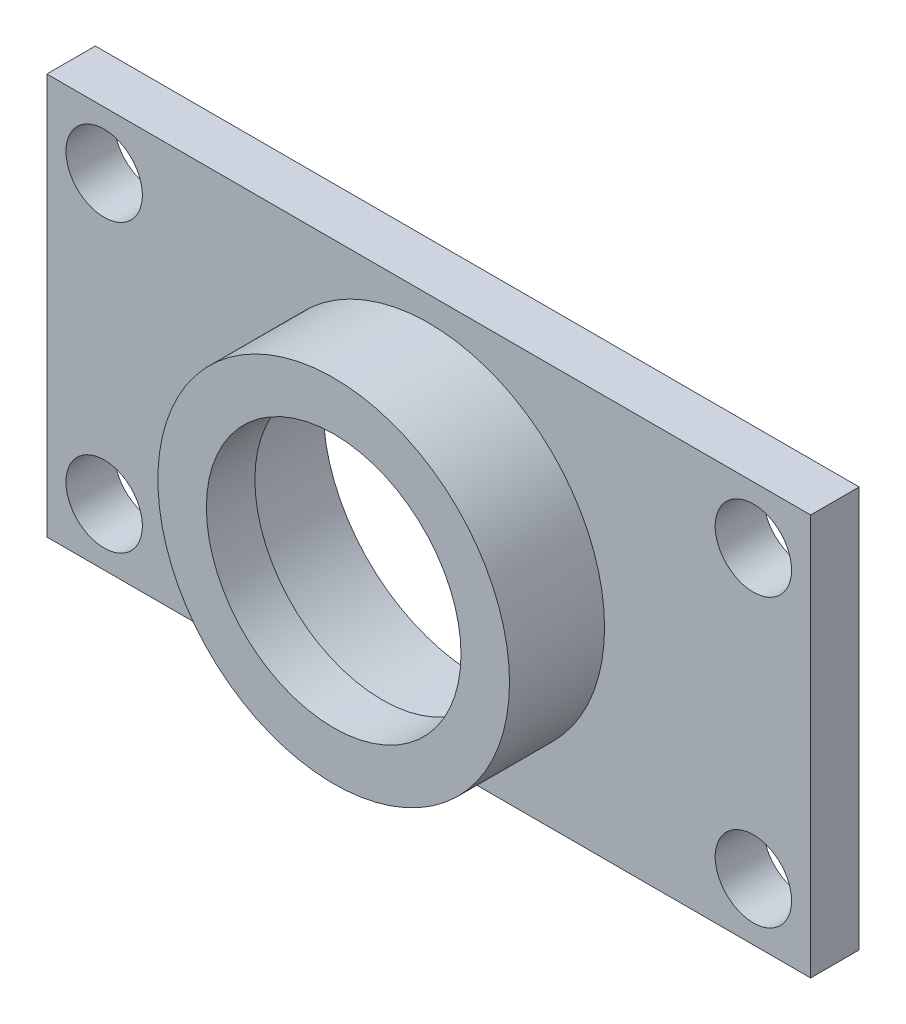
ISO-10303-21;
HEADER;
FILE_DESCRIPTION(('STEP AP214'),'2;1');
FILE_NAME('part.step','',(''),(''),'','','');
FILE_SCHEMA(('AUTOMOTIVE_DESIGN { 1 0 10303 214 1 1 1 1 }'));
ENDSEC;
DATA;
#1=APPLICATION_CONTEXT('core data for automotive mechanical design processes');
#2=APPLICATION_PROTOCOL_DEFINITION('international standard','automotive_design',2000,#1);
#3=PRODUCT_CONTEXT('',#1,'mechanical');
#4=PRODUCT('Part','Part','',(#3));
#5=PRODUCT_RELATED_PRODUCT_CATEGORY('part','',(#4));
#6=PRODUCT_DEFINITION_FORMATION('','',#4);
#7=PRODUCT_DEFINITION_CONTEXT('part definition',#1,'design');
#8=PRODUCT_DEFINITION('design','',#6,#7);
#9=PRODUCT_DEFINITION_SHAPE('','',#8);
#10=(LENGTH_UNIT() NAMED_UNIT(*) SI_UNIT(.MILLI.,.METRE.));
#11=(NAMED_UNIT(*) PLANE_ANGLE_UNIT() SI_UNIT($,.RADIAN.));
#12=(NAMED_UNIT(*) SI_UNIT($,.STERADIAN.) SOLID_ANGLE_UNIT());
#13=UNCERTAINTY_MEASURE_WITH_UNIT(LENGTH_MEASURE(1.E-05),#10,'distance_accuracy_value','');
#14=(GEOMETRIC_REPRESENTATION_CONTEXT(3) GLOBAL_UNCERTAINTY_ASSIGNED_CONTEXT((#13)) GLOBAL_UNIT_ASSIGNED_CONTEXT((#10,
#11,#12)) REPRESENTATION_CONTEXT('',''));
#15=CARTESIAN_POINT('',(0.,0.,0.));
#16=DIRECTION('',(0.,0.,1.));
#17=DIRECTION('',(1.,0.,0.));
#18=AXIS2_PLACEMENT_3D('',#15,#16,#17);
#19=CARTESIAN_POINT('',(0.,0.,2.54));
#20=DIRECTION('',(1.,0.,0.));
#21=DIRECTION('',(0.,0.,-1.));
#22=AXIS2_PLACEMENT_3D('',#19,#20,#21);
#23=PLANE('',#22);
#24=DIRECTION('',(0.,-1.,0.));
#25=VECTOR('',#24,1.);
#26=CARTESIAN_POINT('',(0.,0.,0.));
#27=LINE('',#26,#25);
#28=CARTESIAN_POINT('',(0.,21.,0.));
#29=VERTEX_POINT('',#28);
#30=CARTESIAN_POINT('',(0.,0.,0.));
#31=VERTEX_POINT('',#30);
#32=EDGE_CURVE('E99',#29,#31,#27,.T.);
#33=ORIENTED_EDGE('',*,*,#32,.T.);
#34=DIRECTION('',(0.,0.,-1.));
#35=VECTOR('',#34,1.);
#36=CARTESIAN_POINT('',(0.,0.,2.54));
#37=LINE('',#36,#35);
#38=CARTESIAN_POINT('',(0.,0.,2.54));
#39=VERTEX_POINT('',#38);
#40=EDGE_CURVE('E36',#39,#31,#37,.T.);
#41=ORIENTED_EDGE('',*,*,#40,.F.);
#42=DIRECTION('',(0.,-1.,0.));
#43=VECTOR('',#42,1.);
#44=CARTESIAN_POINT('',(0.,0.,2.54));
#45=LINE('',#44,#43);
#46=CARTESIAN_POINT('',(0.,21.,2.54));
#47=VERTEX_POINT('',#46);
#48=EDGE_CURVE('E86',#47,#39,#45,.T.);
#49=ORIENTED_EDGE('',*,*,#48,.F.);
#50=DIRECTION('',(0.,0.,-1.));
#51=VECTOR('',#50,1.);
#52=CARTESIAN_POINT('',(0.,21.,2.54));
#53=LINE('',#52,#51);
#54=EDGE_CURVE('E95',#47,#29,#53,.T.);
#55=ORIENTED_EDGE('',*,*,#54,.T.);
#56=EDGE_LOOP('',(#33,#41,#49,#55));
#57=FACE_BOUND('',#56,.T.);
#58=ADVANCED_FACE('F33',(#57),#23,.F.);
#59=CARTESIAN_POINT('',(0.,0.,2.54));
#60=DIRECTION('',(0.,1.,0.));
#61=DIRECTION('',(0.,0.,1.));
#62=AXIS2_PLACEMENT_3D('',#59,#60,#61);
#63=PLANE('',#62);
#64=DIRECTION('',(1.,0.,0.));
#65=VECTOR('',#64,1.);
#66=CARTESIAN_POINT('',(0.,0.,0.));
#67=LINE('',#66,#65);
#68=CARTESIAN_POINT('',(40.,0.,0.));
#69=VERTEX_POINT('',#68);
#70=EDGE_CURVE('E91',#31,#69,#67,.T.);
#71=ORIENTED_EDGE('',*,*,#70,.T.);
#72=DIRECTION('',(0.,0.,-1.));
#73=VECTOR('',#72,1.);
#74=CARTESIAN_POINT('',(40.,0.,2.54));
#75=LINE('',#74,#73);
#76=CARTESIAN_POINT('',(40.,0.,2.54));
#77=VERTEX_POINT('',#76);
#78=EDGE_CURVE('E89',#77,#69,#75,.T.);
#79=ORIENTED_EDGE('',*,*,#78,.F.);
#80=DIRECTION('',(1.,0.,0.));
#81=VECTOR('',#80,1.);
#82=CARTESIAN_POINT('',(0.,0.,2.54));
#83=LINE('',#82,#81);
#84=EDGE_CURVE('E81',#39,#77,#83,.T.);
#85=ORIENTED_EDGE('',*,*,#84,.F.);
#86=ORIENTED_EDGE('',*,*,#40,.T.);
#87=EDGE_LOOP('',(#71,#79,#85,#86));
#88=FACE_BOUND('',#87,.T.);
#89=ADVANCED_FACE('F90',(#88),#63,.F.);
#90=CARTESIAN_POINT('',(40.,0.,2.54));
#91=DIRECTION('',(-1.,0.,0.));
#92=DIRECTION('',(0.,0.,1.));
#93=AXIS2_PLACEMENT_3D('',#90,#91,#92);
#94=PLANE('',#93);
#95=DIRECTION('',(0.,1.,0.));
#96=VECTOR('',#95,1.);
#97=CARTESIAN_POINT('',(40.,0.,0.));
#98=LINE('',#97,#96);
#99=CARTESIAN_POINT('',(40.,21.,0.));
#100=VERTEX_POINT('',#99);
#101=EDGE_CURVE('E67',#69,#100,#98,.T.);
#102=ORIENTED_EDGE('',*,*,#101,.T.);
#103=DIRECTION('',(0.,0.,-1.));
#104=VECTOR('',#103,1.);
#105=CARTESIAN_POINT('',(40.,21.,2.54));
#106=LINE('',#105,#104);
#107=CARTESIAN_POINT('',(40.,21.,2.54));
#108=VERTEX_POINT('',#107);
#109=EDGE_CURVE('E92',#108,#100,#106,.T.);
#110=ORIENTED_EDGE('',*,*,#109,.F.);
#111=DIRECTION('',(0.,1.,0.));
#112=VECTOR('',#111,1.);
#113=CARTESIAN_POINT('',(40.,0.,2.54));
#114=LINE('',#113,#112);
#115=EDGE_CURVE('E84',#77,#108,#114,.T.);
#116=ORIENTED_EDGE('',*,*,#115,.F.);
#117=ORIENTED_EDGE('',*,*,#78,.T.);
#118=EDGE_LOOP('',(#102,#110,#116,#117));
#119=FACE_BOUND('',#118,.T.);
#120=ADVANCED_FACE('F93',(#119),#94,.F.);
#121=CARTESIAN_POINT('',(0.,21.,2.54));
#122=DIRECTION('',(0.,-1.,0.));
#123=DIRECTION('',(0.,0.,-1.));
#124=AXIS2_PLACEMENT_3D('',#121,#122,#123);
#125=PLANE('',#124);
#126=DIRECTION('',(-1.,0.,0.));
#127=VECTOR('',#126,1.);
#128=CARTESIAN_POINT('',(0.,21.,0.));
#129=LINE('',#128,#127);
#130=EDGE_CURVE('E73',#100,#29,#129,.T.);
#131=ORIENTED_EDGE('',*,*,#130,.T.);
#132=ORIENTED_EDGE('',*,*,#54,.F.);
#133=DIRECTION('',(-1.,0.,0.));
#134=VECTOR('',#133,1.);
#135=CARTESIAN_POINT('',(0.,21.,2.54));
#136=LINE('',#135,#134);
#137=EDGE_CURVE('E50',#108,#47,#136,.T.);
#138=ORIENTED_EDGE('',*,*,#137,.F.);
#139=ORIENTED_EDGE('',*,*,#109,.T.);
#140=EDGE_LOOP('',(#131,#132,#138,#139));
#141=FACE_BOUND('',#140,.T.);
#142=ADVANCED_FACE('F107',(#141),#125,.F.);
#143=CARTESIAN_POINT('',(0.,0.,2.54));
#144=DIRECTION('',(0.,0.,-1.));
#145=DIRECTION('',(-1.,0.,0.));
#146=AXIS2_PLACEMENT_3D('',#143,#144,#145);
#147=PLANE('',#146);
#148=CARTESIAN_POINT('',(37.000006,2.999994,2.54));
#149=DIRECTION('',(0.,0.,1.));
#150=DIRECTION('',(1.,0.,0.));
#151=AXIS2_PLACEMENT_3D('',#148,#149,#150);
#152=CIRCLE('',#151,1.999996);
#153=CARTESIAN_POINT('',(39.000002,2.999994,2.54));
#154=VERTEX_POINT('',#153);
#155=EDGE_CURVE('E141',#154,#154,#152,.T.);
#156=ORIENTED_EDGE('',*,*,#155,.F.);
#157=EDGE_LOOP('',(#156));
#158=FACE_BOUND('',#157,.T.);
#159=CARTESIAN_POINT('',(3.0000156,2.99999399999999,2.54));
#160=DIRECTION('',(0.,0.,1.));
#161=DIRECTION('',(-1.,0.,0.));
#162=AXIS2_PLACEMENT_3D('',#159,#160,#161);
#163=CIRCLE('',#162,1.999996);
#164=CARTESIAN_POINT('',(1.00001960000001,2.99999399999999,2.54));
#165=VERTEX_POINT('',#164);
#166=EDGE_CURVE('E122',#165,#165,#163,.T.);
#167=ORIENTED_EDGE('',*,*,#166,.F.);
#168=EDGE_LOOP('',(#167));
#169=FACE_BOUND('',#168,.T.);
#170=CARTESIAN_POINT('',(37.000006,18.000006,2.54));
#171=DIRECTION('',(0.,0.,1.));
#172=DIRECTION('',(1.,0.,0.));
#173=AXIS2_PLACEMENT_3D('',#170,#171,#172);
#174=CIRCLE('',#173,1.999996);
#175=CARTESIAN_POINT('',(39.000002,18.000006,2.54));
#176=VERTEX_POINT('',#175);
#177=EDGE_CURVE('E131',#176,#176,#174,.T.);
#178=ORIENTED_EDGE('',*,*,#177,.F.);
#179=EDGE_LOOP('',(#178));
#180=FACE_BOUND('',#179,.T.);
#181=CARTESIAN_POINT('',(3.0000156,18.000006,2.54));
#182=DIRECTION('',(0.,0.,1.));
#183=DIRECTION('',(-1.,0.,0.));
#184=AXIS2_PLACEMENT_3D('',#181,#182,#183);
#185=CIRCLE('',#184,1.999996);
#186=CARTESIAN_POINT('',(1.0000196,18.000006,2.54));
#187=VERTEX_POINT('',#186);
#188=EDGE_CURVE('E124',#187,#187,#185,.T.);
#189=ORIENTED_EDGE('',*,*,#188,.F.);
#190=EDGE_LOOP('',(#189));
#191=FACE_BOUND('',#190,.T.);
#192=CARTESIAN_POINT('',(20.0000108,10.49999932,2.54));
#193=DIRECTION('',(0.,0.,1.));
#194=DIRECTION('',(1.,0.,0.));
#195=AXIS2_PLACEMENT_3D('',#192,#193,#194);
#196=CIRCLE('',#195,9.2075);
#197=CARTESIAN_POINT('',(29.2075108,10.49999932,2.54));
#198=VERTEX_POINT('',#197);
#199=EDGE_CURVE('E11',#198,#198,#196,.T.);
#200=ORIENTED_EDGE('',*,*,#199,.F.);
#201=EDGE_LOOP('',(#200));
#202=FACE_BOUND('',#201,.T.);
#203=ORIENTED_EDGE('',*,*,#48,.T.);
#204=ORIENTED_EDGE('',*,*,#84,.T.);
#205=ORIENTED_EDGE('',*,*,#115,.T.);
#206=ORIENTED_EDGE('',*,*,#137,.T.);
#207=EDGE_LOOP('',(#203,#204,#205,#206));
#208=FACE_BOUND('',#207,.T.);
#209=ADVANCED_FACE('F82',(#158,#169,#180,#191,#202,#208),#147,.F.);
#210=CARTESIAN_POINT('',(0.,0.,0.));
#211=DIRECTION('',(0.,0.,-1.));
#212=DIRECTION('',(-1.,0.,0.));
#213=AXIS2_PLACEMENT_3D('',#210,#211,#212);
#214=PLANE('',#213);
#215=CARTESIAN_POINT('',(19.9999892,10.49999932,0.));
#216=DIRECTION('',(0.,0.,-1.));
#217=DIRECTION('',(-1.,0.,0.));
#218=AXIS2_PLACEMENT_3D('',#215,#216,#217);
#219=CIRCLE('',#218,8.0645);
#220=CARTESIAN_POINT('',(11.9354892,10.49999932,0.));
#221=VERTEX_POINT('',#220);
#222=EDGE_CURVE('E146',#221,#221,#219,.T.);
#223=ORIENTED_EDGE('',*,*,#222,.F.);
#224=EDGE_LOOP('',(#223));
#225=FACE_BOUND('',#224,.T.);
#226=CARTESIAN_POINT('',(37.000006,2.999994,0.));
#227=DIRECTION('',(0.,0.,1.));
#228=DIRECTION('',(1.,0.,0.));
#229=AXIS2_PLACEMENT_3D('',#226,#227,#228);
#230=CIRCLE('',#229,1.999996);
#231=CARTESIAN_POINT('',(39.000002,2.999994,0.));
#232=VERTEX_POINT('',#231);
#233=EDGE_CURVE('E128',#232,#232,#230,.T.);
#234=ORIENTED_EDGE('',*,*,#233,.T.);
#235=EDGE_LOOP('',(#234));
#236=FACE_BOUND('',#235,.T.);
#237=CARTESIAN_POINT('',(3.0000156,2.99999399999999,0.));
#238=DIRECTION('',(0.,0.,1.));
#239=DIRECTION('',(-1.,0.,0.));
#240=AXIS2_PLACEMENT_3D('',#237,#238,#239);
#241=CIRCLE('',#240,1.999996);
#242=CARTESIAN_POINT('',(1.00001960000001,2.99999399999999,0.));
#243=VERTEX_POINT('',#242);
#244=EDGE_CURVE('E138',#243,#243,#241,.T.);
#245=ORIENTED_EDGE('',*,*,#244,.T.);
#246=EDGE_LOOP('',(#245));
#247=FACE_BOUND('',#246,.T.);
#248=CARTESIAN_POINT('',(37.000006,18.000006,0.));
#249=DIRECTION('',(0.,0.,1.));
#250=DIRECTION('',(1.,0.,0.));
#251=AXIS2_PLACEMENT_3D('',#248,#249,#250);
#252=CIRCLE('',#251,1.999996);
#253=CARTESIAN_POINT('',(39.000002,18.000006,0.));
#254=VERTEX_POINT('',#253);
#255=EDGE_CURVE('E118',#254,#254,#252,.T.);
#256=ORIENTED_EDGE('',*,*,#255,.T.);
#257=EDGE_LOOP('',(#256));
#258=FACE_BOUND('',#257,.T.);
#259=CARTESIAN_POINT('',(3.0000156,18.000006,0.));
#260=DIRECTION('',(0.,0.,1.));
#261=DIRECTION('',(-1.,0.,0.));
#262=AXIS2_PLACEMENT_3D('',#259,#260,#261);
#263=CIRCLE('',#262,1.999996);
#264=CARTESIAN_POINT('',(1.0000196,18.000006,0.));
#265=VERTEX_POINT('',#264);
#266=EDGE_CURVE('E127',#265,#265,#263,.T.);
#267=ORIENTED_EDGE('',*,*,#266,.T.);
#268=EDGE_LOOP('',(#267));
#269=FACE_BOUND('',#268,.T.);
#270=ORIENTED_EDGE('',*,*,#32,.F.);
#271=ORIENTED_EDGE('',*,*,#130,.F.);
#272=ORIENTED_EDGE('',*,*,#101,.F.);
#273=ORIENTED_EDGE('',*,*,#70,.F.);
#274=EDGE_LOOP('',(#270,#271,#272,#273));
#275=FACE_BOUND('',#274,.T.);
#276=ADVANCED_FACE('F110',(#225,#236,#247,#258,#269,#275),#214,.T.);
#277=CARTESIAN_POINT('',(20.0000108,10.49999932,7.5184));
#278=DIRECTION('',(0.,0.,-1.));
#279=DIRECTION('',(-1.,0.,0.));
#280=AXIS2_PLACEMENT_3D('',#277,#278,#279);
#281=CYLINDRICAL_SURFACE('',#280,9.2075);
#282=CARTESIAN_POINT('',(20.0000108,10.49999932,7.5184));
#283=DIRECTION('',(0.,0.,1.));
#284=DIRECTION('',(1.,0.,0.));
#285=AXIS2_PLACEMENT_3D('',#282,#283,#284);
#286=CIRCLE('',#285,9.2075);
#287=CARTESIAN_POINT('',(29.2075108,10.49999932,7.5184));
#288=VERTEX_POINT('',#287);
#289=EDGE_CURVE('E102',#288,#288,#286,.T.);
#290=ORIENTED_EDGE('',*,*,#289,.F.);
#291=EDGE_LOOP('',(#290));
#292=FACE_BOUND('',#291,.T.);
#293=ORIENTED_EDGE('',*,*,#199,.T.);
#294=EDGE_LOOP('',(#293));
#295=FACE_BOUND('',#294,.T.);
#296=ADVANCED_FACE('F163',(#292,#295),#281,.T.);
#297=CARTESIAN_POINT('',(20.0000108,10.49999932,7.5184));
#298=DIRECTION('',(0.,0.,1.));
#299=DIRECTION('',(1.,0.,0.));
#300=AXIS2_PLACEMENT_3D('',#297,#298,#299);
#301=PLANE('',#300);
#302=CARTESIAN_POINT('',(20.0000108,10.49999932,7.5184));
#303=DIRECTION('',(0.,0.,1.));
#304=DIRECTION('',(1.,0.,0.));
#305=AXIS2_PLACEMENT_3D('',#302,#303,#304);
#306=CIRCLE('',#305,6.6675);
#307=CARTESIAN_POINT('',(26.6675108,10.49999932,7.5184));
#308=VERTEX_POINT('',#307);
#309=EDGE_CURVE('E115',#308,#308,#306,.T.);
#310=ORIENTED_EDGE('',*,*,#309,.F.);
#311=EDGE_LOOP('',(#310));
#312=FACE_BOUND('',#311,.T.);
#313=ORIENTED_EDGE('',*,*,#289,.T.);
#314=EDGE_LOOP('',(#313));
#315=FACE_BOUND('',#314,.T.);
#316=ADVANCED_FACE('F188',(#312,#315),#301,.T.);
#317=CARTESIAN_POINT('',(20.0000108,10.49999932,4.9784));
#318=DIRECTION('',(0.,0.,1.));
#319=DIRECTION('',(1.,0.,0.));
#320=AXIS2_PLACEMENT_3D('',#317,#318,#319);
#321=CYLINDRICAL_SURFACE('',#320,6.6675);
#322=CARTESIAN_POINT('',(20.0000108,10.49999932,4.9784));
#323=DIRECTION('',(0.,0.,1.));
#324=DIRECTION('',(1.,0.,0.));
#325=AXIS2_PLACEMENT_3D('',#322,#323,#324);
#326=CIRCLE('',#325,6.6675);
#327=CARTESIAN_POINT('',(26.6675108,10.49999932,4.9784));
#328=VERTEX_POINT('',#327);
#329=EDGE_CURVE('E119',#328,#328,#326,.T.);
#330=ORIENTED_EDGE('',*,*,#329,.F.);
#331=EDGE_LOOP('',(#330));
#332=FACE_BOUND('',#331,.T.);
#333=ORIENTED_EDGE('',*,*,#309,.T.);
#334=EDGE_LOOP('',(#333));
#335=FACE_BOUND('',#334,.T.);
#336=ADVANCED_FACE('F177',(#332,#335),#321,.F.);
#337=CARTESIAN_POINT('',(3.0000156,18.000006,0.));
#338=DIRECTION('',(0.,0.,1.));
#339=DIRECTION('',(1.,0.,0.));
#340=AXIS2_PLACEMENT_3D('',#337,#338,#339);
#341=CYLINDRICAL_SURFACE('',#340,1.999996);
#342=ORIENTED_EDGE('',*,*,#266,.F.);
#343=EDGE_LOOP('',(#342));
#344=FACE_BOUND('',#343,.T.);
#345=ORIENTED_EDGE('',*,*,#188,.T.);
#346=EDGE_LOOP('',(#345));
#347=FACE_BOUND('',#346,.T.);
#348=ADVANCED_FACE('F173',(#344,#347),#341,.F.);
#349=CARTESIAN_POINT('',(37.000006,18.000006,0.));
#350=DIRECTION('',(0.,0.,1.));
#351=DIRECTION('',(1.,0.,0.));
#352=AXIS2_PLACEMENT_3D('',#349,#350,#351);
#353=CYLINDRICAL_SURFACE('',#352,1.999996);
#354=ORIENTED_EDGE('',*,*,#255,.F.);
#355=EDGE_LOOP('',(#354));
#356=FACE_BOUND('',#355,.T.);
#357=ORIENTED_EDGE('',*,*,#177,.T.);
#358=EDGE_LOOP('',(#357));
#359=FACE_BOUND('',#358,.T.);
#360=ADVANCED_FACE('F176',(#356,#359),#353,.F.);
#361=CARTESIAN_POINT('',(3.0000156,2.99999399999999,0.));
#362=DIRECTION('',(0.,0.,1.));
#363=DIRECTION('',(1.,0.,0.));
#364=AXIS2_PLACEMENT_3D('',#361,#362,#363);
#365=CYLINDRICAL_SURFACE('',#364,1.999996);
#366=ORIENTED_EDGE('',*,*,#244,.F.);
#367=EDGE_LOOP('',(#366));
#368=FACE_BOUND('',#367,.T.);
#369=ORIENTED_EDGE('',*,*,#166,.T.);
#370=EDGE_LOOP('',(#369));
#371=FACE_BOUND('',#370,.T.);
#372=ADVANCED_FACE('F247',(#368,#371),#365,.F.);
#373=CARTESIAN_POINT('',(37.000006,2.999994,0.));
#374=DIRECTION('',(0.,0.,1.));
#375=DIRECTION('',(1.,0.,0.));
#376=AXIS2_PLACEMENT_3D('',#373,#374,#375);
#377=CYLINDRICAL_SURFACE('',#376,1.999996);
#378=ORIENTED_EDGE('',*,*,#233,.F.);
#379=EDGE_LOOP('',(#378));
#380=FACE_BOUND('',#379,.T.);
#381=ORIENTED_EDGE('',*,*,#155,.T.);
#382=EDGE_LOOP('',(#381));
#383=FACE_BOUND('',#382,.T.);
#384=ADVANCED_FACE('F228',(#380,#383),#377,.F.);
#385=CARTESIAN_POINT('',(19.9999892,10.49999932,4.9784));
#386=DIRECTION('',(0.,0.,-1.));
#387=DIRECTION('',(-1.,0.,0.));
#388=AXIS2_PLACEMENT_3D('',#385,#386,#387);
#389=PLANE('',#388);
#390=CARTESIAN_POINT('',(19.9999892,10.49999932,4.9784));
#391=DIRECTION('',(0.,0.,-1.));
#392=DIRECTION('',(-1.,0.,0.));
#393=AXIS2_PLACEMENT_3D('',#390,#391,#392);
#394=CIRCLE('',#393,8.0645);
#395=CARTESIAN_POINT('',(11.9354892,10.49999932,4.9784));
#396=VERTEX_POINT('',#395);
#397=EDGE_CURVE('E123',#396,#396,#394,.T.);
#398=ORIENTED_EDGE('',*,*,#397,.T.);
#399=EDGE_LOOP('',(#398));
#400=FACE_BOUND('',#399,.T.);
#401=ORIENTED_EDGE('',*,*,#329,.T.);
#402=EDGE_LOOP('',(#401));
#403=FACE_BOUND('',#402,.T.);
#404=ADVANCED_FACE('F152',(#400,#403),#389,.T.);
#405=CARTESIAN_POINT('',(19.9999892,10.49999932,4.9784));
#406=DIRECTION('',(0.,0.,-1.));
#407=DIRECTION('',(-1.,0.,0.));
#408=AXIS2_PLACEMENT_3D('',#405,#406,#407);
#409=CYLINDRICAL_SURFACE('',#408,8.0645);
#410=ORIENTED_EDGE('',*,*,#397,.F.);
#411=EDGE_LOOP('',(#410));
#412=FACE_BOUND('',#411,.T.);
#413=ORIENTED_EDGE('',*,*,#222,.T.);
#414=EDGE_LOOP('',(#413));
#415=FACE_BOUND('',#414,.T.);
#416=ADVANCED_FACE('F155',(#412,#415),#409,.F.);
#417=CLOSED_SHELL('',(#58,#89,#120,#142,#209,#276,#296,#316,#336,#348,#360,#372,#384,#404,#416));
#418=MANIFOLD_SOLID_BREP('B2',#417);
#419=ADVANCED_BREP_SHAPE_REPRESENTATION('',(#18,#418),#14);
#420=SHAPE_DEFINITION_REPRESENTATION(#9,#419);
ENDSEC;
END-ISO-10303-21;
